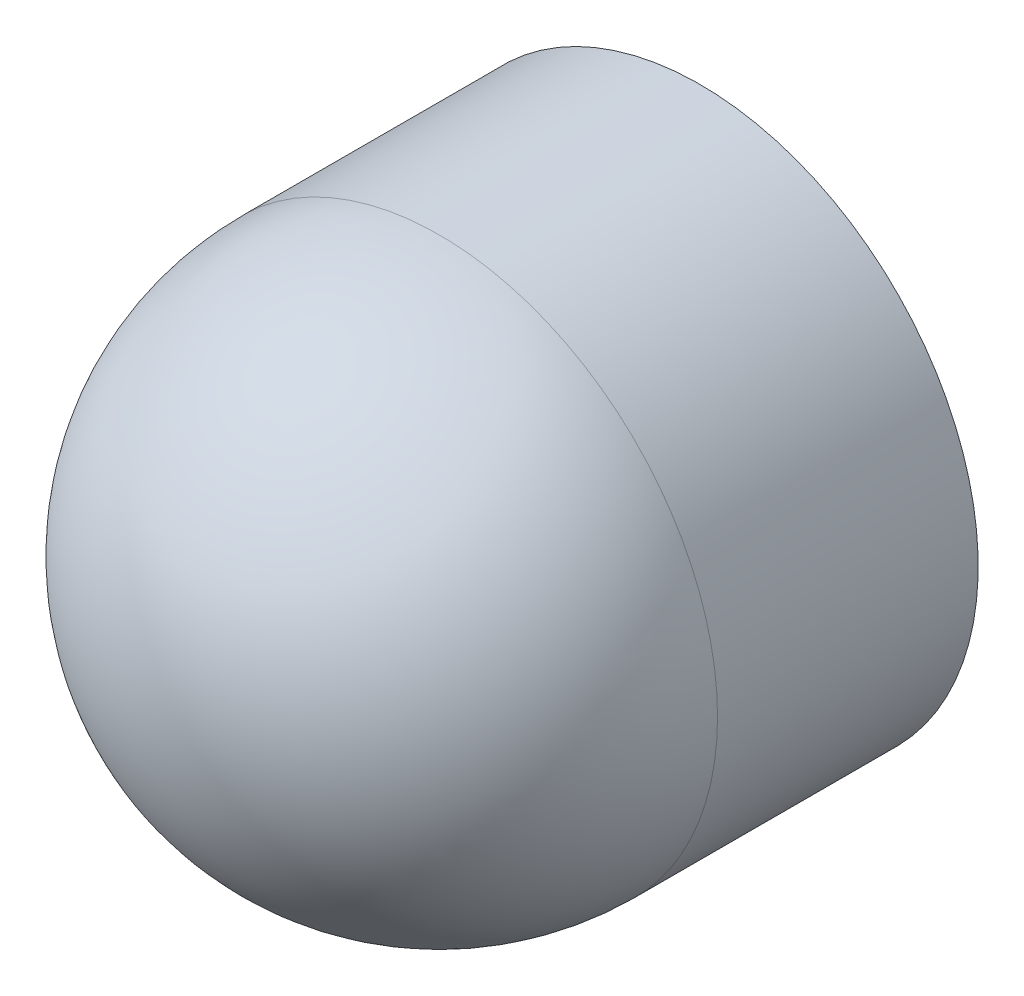
ISO-10303-21;
HEADER;
FILE_DESCRIPTION(('STEP AP214'),'2;1');
FILE_NAME('part.step','',(''),(''),'','','');
FILE_SCHEMA(('AUTOMOTIVE_DESIGN { 1 0 10303 214 1 1 1 1 }'));
ENDSEC;
DATA;
#1=APPLICATION_CONTEXT('core data for automotive mechanical design processes');
#2=APPLICATION_PROTOCOL_DEFINITION('international standard','automotive_design',2000,#1);
#3=PRODUCT_CONTEXT('',#1,'mechanical');
#4=PRODUCT('Part','Part','',(#3));
#5=PRODUCT_RELATED_PRODUCT_CATEGORY('part','',(#4));
#6=PRODUCT_DEFINITION_FORMATION('','',#4);
#7=PRODUCT_DEFINITION_CONTEXT('part definition',#1,'design');
#8=PRODUCT_DEFINITION('design','',#6,#7);
#9=PRODUCT_DEFINITION_SHAPE('','',#8);
#10=(LENGTH_UNIT() NAMED_UNIT(*) SI_UNIT(.MILLI.,.METRE.));
#11=(NAMED_UNIT(*) PLANE_ANGLE_UNIT() SI_UNIT($,.RADIAN.));
#12=(NAMED_UNIT(*) SI_UNIT($,.STERADIAN.) SOLID_ANGLE_UNIT());
#13=UNCERTAINTY_MEASURE_WITH_UNIT(LENGTH_MEASURE(1.E-05),#10,'distance_accuracy_value','');
#14=(GEOMETRIC_REPRESENTATION_CONTEXT(3) GLOBAL_UNCERTAINTY_ASSIGNED_CONTEXT((#13)) GLOBAL_UNIT_ASSIGNED_CONTEXT((#10,
#11,#12)) REPRESENTATION_CONTEXT('',''));
#15=CARTESIAN_POINT('',(0.,0.,0.));
#16=DIRECTION('',(0.,0.,1.));
#17=DIRECTION('',(1.,0.,0.));
#18=AXIS2_PLACEMENT_3D('',#15,#16,#17);
#19=CARTESIAN_POINT('',(57.404,4.826,15.9766));
#20=DIRECTION('',(0.,0.,1.));
#21=DIRECTION('',(1.,0.,0.));
#22=AXIS2_PLACEMENT_3D('',#19,#20,#21);
#23=SPHERICAL_SURFACE('',#22,2.413);
#24=CARTESIAN_POINT('',(57.404,4.826,13.5636));
#25=CARTESIAN_POINT('',(57.3680757344586,4.826,13.5635994260811));
#26=CARTESIAN_POINT('',(57.3321515132562,4.826,13.5644022285456));
#27=CARTESIAN_POINT('',(57.2603746974066,4.826,13.5676104647727));
#28=CARTESIAN_POINT('',(57.2245221027594,4.826,13.5700158985355));
#29=CARTESIAN_POINT('',(57.1529600778973,4.826,13.5764252758911));
#30=CARTESIAN_POINT('',(57.1172506476824,4.826,13.5804292194839));
#31=CARTESIAN_POINT('',(57.046046164482,4.826,13.5900274464457));
#32=CARTESIAN_POINT('',(57.0105511114967,4.826,13.5956217298147));
#33=CARTESIAN_POINT('',(56.9398461832837,4.826,13.6083895394651));
#34=CARTESIAN_POINT('',(56.9046363080562,4.826,13.6155630657465));
#35=CARTESIAN_POINT('',(56.8345719454318,4.826,13.6314749945633));
#36=CARTESIAN_POINT('',(56.7997174580349,4.826,13.6402133970987));
#37=CARTESIAN_POINT('',(56.7304334437162,4.826,13.6592378256139));
#38=CARTESIAN_POINT('',(56.6960039167943,4.82599999999999,13.6695238515938));
#39=CARTESIAN_POINT('',(56.6276382846151,4.82599999999999,13.6916223676058));
#40=CARTESIAN_POINT('',(56.5937021793578,4.82599999999999,13.7034348576379));
#41=CARTESIAN_POINT('',(56.5600470155275,4.82599999999999,13.716));
#42=B_SPLINE_CURVE_WITH_KNOTS('',3,(#24,#25,#26,#27,#28,#29,#30,#31,#32,#33,#34,#35,#36,#37,#38,
#39,#40,#41),.UNSPECIFIED.,.F.,.F.,(4,2,2,2,2,2,2,2,4),(0.,0.107763764675709,0.215527529351421,
0.323291294027137,0.431055058702845,0.538818823378556,0.646582588054271,0.754346352729982,
0.862110117405694),.UNSPECIFIED.);
#43=CARTESIAN_POINT('',(57.404,4.826,13.5636));
#44=VERTEX_POINT('',#43);
#45=CARTESIAN_POINT('',(56.5600470155275,4.826,13.716));
#46=VERTEX_POINT('',#45);
#47=EDGE_CURVE('E39',#44,#46,#42,.T.);
#48=ORIENTED_EDGE('',*,*,#47,.T.);
#49=CARTESIAN_POINT('',(57.404,4.826,13.716));
#50=DIRECTION('',(0.,0.,1.));
#51=DIRECTION('',(1.,0.,0.));
#52=AXIS2_PLACEMENT_3D('',#49,#50,#51);
#53=CIRCLE('',#52,0.843952984472478);
#54=EDGE_CURVE('E33',#46,#46,#53,.T.);
#55=ORIENTED_EDGE('',*,*,#54,.F.);
#56=ORIENTED_EDGE('',*,*,#47,.F.);
#57=EDGE_LOOP('',(#48,#55,#56));
#58=FACE_BOUND('',#57,.T.);
#59=ADVANCED_FACE('F17',(#58),#23,.T.);
#60=CARTESIAN_POINT('',(57.404,4.826,15.9766));
#61=DIRECTION('',(0.,0.,1.));
#62=DIRECTION('',(1.,0.,0.));
#63=AXIS2_PLACEMENT_3D('',#60,#61,#62);
#64=SPHERICAL_SURFACE('',#63,2.413);
#65=CARTESIAN_POINT('',(57.404,4.826,18.3896));
#66=VERTEX_POINT('',#65);
#67=VERTEX_LOOP('',#66);
#68=FACE_BOUND('',#67,.T.);
#69=CARTESIAN_POINT('',(57.404,4.826,15.9766));
#70=DIRECTION('',(0.,0.,-1.));
#71=DIRECTION('',(-1.,0.,0.));
#72=AXIS2_PLACEMENT_3D('',#69,#70,#71);
#73=CIRCLE('',#72,2.41300000000001);
#74=CARTESIAN_POINT('',(54.991,4.826,15.9766));
#75=VERTEX_POINT('',#74);
#76=EDGE_CURVE('E27',#75,#75,#73,.T.);
#77=ORIENTED_EDGE('',*,*,#76,.F.);
#78=EDGE_LOOP('',(#77));
#79=FACE_BOUND('',#78,.T.);
#80=ADVANCED_FACE('F56',(#68,#79),#64,.T.);
#81=CARTESIAN_POINT('',(60.2996,1.9304,13.716));
#82=DIRECTION('',(0.,0.,-1.));
#83=DIRECTION('',(-1.,0.,0.));
#84=AXIS2_PLACEMENT_3D('',#81,#82,#83);
#85=PLANE('',#84);
#86=ORIENTED_EDGE('',*,*,#54,.T.);
#87=EDGE_LOOP('',(#86));
#88=FACE_BOUND('',#87,.T.);
#89=CARTESIAN_POINT('',(57.404,4.826,13.716));
#90=DIRECTION('',(0.,0.,-1.));
#91=DIRECTION('',(-1.,0.,0.));
#92=AXIS2_PLACEMENT_3D('',#89,#90,#91);
#93=CIRCLE('',#92,2.41300000000001);
#94=CARTESIAN_POINT('',(54.991,4.826,13.716));
#95=VERTEX_POINT('',#94);
#96=EDGE_CURVE('E11',#95,#95,#93,.F.);
#97=ORIENTED_EDGE('',*,*,#96,.F.);
#98=EDGE_LOOP('',(#97));
#99=FACE_BOUND('',#98,.T.);
#100=ADVANCED_FACE('F19',(#88,#99),#85,.T.);
#101=CARTESIAN_POINT('',(57.404,4.826,13.716));
#102=DIRECTION('',(0.,0.,-1.));
#103=DIRECTION('',(-1.,0.,0.));
#104=AXIS2_PLACEMENT_3D('',#101,#102,#103);
#105=CYLINDRICAL_SURFACE('',#104,2.41300000000001);
#106=ORIENTED_EDGE('',*,*,#76,.T.);
#107=EDGE_LOOP('',(#106));
#108=FACE_BOUND('',#107,.T.);
#109=ORIENTED_EDGE('',*,*,#96,.T.);
#110=EDGE_LOOP('',(#109));
#111=FACE_BOUND('',#110,.T.);
#112=ADVANCED_FACE('F72',(#108,#111),#105,.T.);
#113=CLOSED_SHELL('',(#59,#80,#100,#112));
#114=MANIFOLD_SOLID_BREP('B1',#113);
#115=ADVANCED_BREP_SHAPE_REPRESENTATION('',(#18,#114),#14);
#116=SHAPE_DEFINITION_REPRESENTATION(#9,#115);
ENDSEC;
END-ISO-10303-21;
